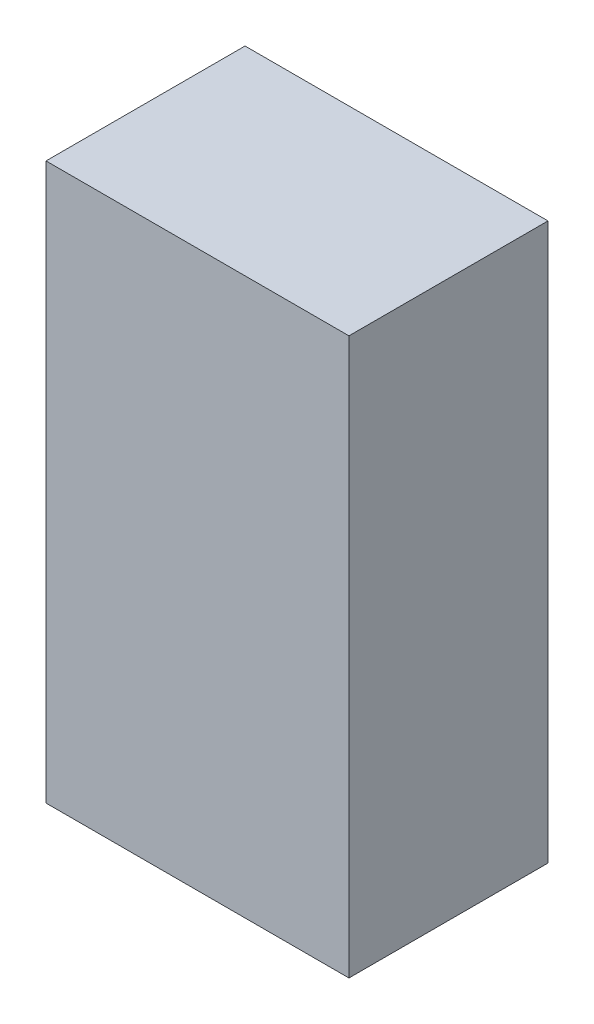
ISO-10303-21;
HEADER;
FILE_DESCRIPTION(('STEP AP214'),'2;1');
FILE_NAME('part.step','',(''),(''),'','','');
FILE_SCHEMA(('AUTOMOTIVE_DESIGN { 1 0 10303 214 1 1 1 1 }'));
ENDSEC;
DATA;
#1=APPLICATION_CONTEXT('core data for automotive mechanical design processes');
#2=APPLICATION_PROTOCOL_DEFINITION('international standard','automotive_design',2000,#1);
#3=PRODUCT_CONTEXT('',#1,'mechanical');
#4=PRODUCT('Part','Part','',(#3));
#5=PRODUCT_RELATED_PRODUCT_CATEGORY('part','',(#4));
#6=PRODUCT_DEFINITION_FORMATION('','',#4);
#7=PRODUCT_DEFINITION_CONTEXT('part definition',#1,'design');
#8=PRODUCT_DEFINITION('design','',#6,#7);
#9=PRODUCT_DEFINITION_SHAPE('','',#8);
#10=(LENGTH_UNIT() NAMED_UNIT(*) SI_UNIT(.MILLI.,.METRE.));
#11=(NAMED_UNIT(*) PLANE_ANGLE_UNIT() SI_UNIT($,.RADIAN.));
#12=(NAMED_UNIT(*) SI_UNIT($,.STERADIAN.) SOLID_ANGLE_UNIT());
#13=UNCERTAINTY_MEASURE_WITH_UNIT(LENGTH_MEASURE(1.E-05),#10,'distance_accuracy_value','');
#14=(GEOMETRIC_REPRESENTATION_CONTEXT(3) GLOBAL_UNCERTAINTY_ASSIGNED_CONTEXT((#13)) GLOBAL_UNIT_ASSIGNED_CONTEXT((#10,
#11,#12)) REPRESENTATION_CONTEXT('',''));
#15=CARTESIAN_POINT('',(0.,0.,0.));
#16=DIRECTION('',(0.,0.,1.));
#17=DIRECTION('',(1.,0.,0.));
#18=AXIS2_PLACEMENT_3D('',#15,#16,#17);
#19=CARTESIAN_POINT('',(0.,0.,13.6));
#20=DIRECTION('',(1.,0.,0.));
#21=DIRECTION('',(0.,1.,0.));
#22=AXIS2_PLACEMENT_3D('',#19,#20,#21);
#23=PLANE('',#22);
#24=DIRECTION('',(0.,-1.,0.));
#25=VECTOR('',#24,1.);
#26=CARTESIAN_POINT('',(0.,0.,0.));
#27=LINE('',#26,#25);
#28=CARTESIAN_POINT('',(0.,0.,0.));
#29=VERTEX_POINT('',#28);
#30=CARTESIAN_POINT('',(0.,-38.,0.));
#31=VERTEX_POINT('',#30);
#32=EDGE_CURVE('E100',#29,#31,#27,.T.);
#33=ORIENTED_EDGE('',*,*,#32,.T.);
#34=DIRECTION('',(0.,0.,-1.));
#35=VECTOR('',#34,1.);
#36=CARTESIAN_POINT('',(0.,-38.,13.6));
#37=LINE('',#36,#35);
#38=CARTESIAN_POINT('',(0.,-38.,13.6));
#39=VERTEX_POINT('',#38);
#40=EDGE_CURVE('E11',#39,#31,#37,.T.);
#41=ORIENTED_EDGE('',*,*,#40,.F.);
#42=DIRECTION('',(0.,-1.,0.));
#43=VECTOR('',#42,1.);
#44=CARTESIAN_POINT('',(0.,0.,13.6));
#45=LINE('',#44,#43);
#46=CARTESIAN_POINT('',(0.,0.,13.6));
#47=VERTEX_POINT('',#46);
#48=EDGE_CURVE('E88',#47,#39,#45,.T.);
#49=ORIENTED_EDGE('',*,*,#48,.F.);
#50=DIRECTION('',(0.,0.,-1.));
#51=VECTOR('',#50,1.);
#52=CARTESIAN_POINT('',(0.,0.,13.6));
#53=LINE('',#52,#51);
#54=EDGE_CURVE('E96',#47,#29,#53,.T.);
#55=ORIENTED_EDGE('',*,*,#54,.T.);
#56=EDGE_LOOP('',(#33,#41,#49,#55));
#57=FACE_BOUND('',#56,.T.);
#58=ADVANCED_FACE('F37',(#57),#23,.F.);
#59=CARTESIAN_POINT('',(0.,-38.,13.6));
#60=DIRECTION('',(0.,1.,0.));
#61=DIRECTION('',(0.,0.,1.));
#62=AXIS2_PLACEMENT_3D('',#59,#60,#61);
#63=PLANE('',#62);
#64=DIRECTION('',(1.,0.,0.));
#65=VECTOR('',#64,1.);
#66=CARTESIAN_POINT('',(0.,-38.,0.));
#67=LINE('',#66,#65);
#68=CARTESIAN_POINT('',(20.7,-38.,0.));
#69=VERTEX_POINT('',#68);
#70=EDGE_CURVE('E92',#31,#69,#67,.T.);
#71=ORIENTED_EDGE('',*,*,#70,.T.);
#72=DIRECTION('',(0.,0.,-1.));
#73=VECTOR('',#72,1.);
#74=CARTESIAN_POINT('',(20.7,-38.,13.6));
#75=LINE('',#74,#73);
#76=CARTESIAN_POINT('',(20.7,-38.,13.6));
#77=VERTEX_POINT('',#76);
#78=EDGE_CURVE('E45',#77,#69,#75,.T.);
#79=ORIENTED_EDGE('',*,*,#78,.F.);
#80=DIRECTION('',(1.,0.,0.));
#81=VECTOR('',#80,1.);
#82=CARTESIAN_POINT('',(0.,-38.,13.6));
#83=LINE('',#82,#81);
#84=EDGE_CURVE('E83',#39,#77,#83,.T.);
#85=ORIENTED_EDGE('',*,*,#84,.F.);
#86=ORIENTED_EDGE('',*,*,#40,.T.);
#87=EDGE_LOOP('',(#71,#79,#85,#86));
#88=FACE_BOUND('',#87,.T.);
#89=ADVANCED_FACE('F91',(#88),#63,.F.);
#90=CARTESIAN_POINT('',(20.7,0.,13.6));
#91=DIRECTION('',(-1.,0.,0.));
#92=DIRECTION('',(0.,-1.,0.));
#93=AXIS2_PLACEMENT_3D('',#90,#91,#92);
#94=PLANE('',#93);
#95=DIRECTION('',(0.,1.,0.));
#96=VECTOR('',#95,1.);
#97=CARTESIAN_POINT('',(20.7,0.,0.));
#98=LINE('',#97,#96);
#99=CARTESIAN_POINT('',(20.7,0.,0.));
#100=VERTEX_POINT('',#99);
#101=EDGE_CURVE('E70',#69,#100,#98,.T.);
#102=ORIENTED_EDGE('',*,*,#101,.T.);
#103=DIRECTION('',(0.,0.,-1.));
#104=VECTOR('',#103,1.);
#105=CARTESIAN_POINT('',(20.7,0.,13.6));
#106=LINE('',#105,#104);
#107=CARTESIAN_POINT('',(20.7,0.,13.6));
#108=VERTEX_POINT('',#107);
#109=EDGE_CURVE('E93',#108,#100,#106,.T.);
#110=ORIENTED_EDGE('',*,*,#109,.F.);
#111=DIRECTION('',(0.,1.,0.));
#112=VECTOR('',#111,1.);
#113=CARTESIAN_POINT('',(20.7,0.,13.6));
#114=LINE('',#113,#112);
#115=EDGE_CURVE('E86',#77,#108,#114,.T.);
#116=ORIENTED_EDGE('',*,*,#115,.F.);
#117=ORIENTED_EDGE('',*,*,#78,.T.);
#118=EDGE_LOOP('',(#102,#110,#116,#117));
#119=FACE_BOUND('',#118,.T.);
#120=ADVANCED_FACE('F94',(#119),#94,.F.);
#121=CARTESIAN_POINT('',(0.,0.,13.6));
#122=DIRECTION('',(0.,-1.,0.));
#123=DIRECTION('',(0.,0.,-1.));
#124=AXIS2_PLACEMENT_3D('',#121,#122,#123);
#125=PLANE('',#124);
#126=DIRECTION('',(-1.,0.,0.));
#127=VECTOR('',#126,1.);
#128=CARTESIAN_POINT('',(0.,0.,0.));
#129=LINE('',#128,#127);
#130=EDGE_CURVE('E76',#100,#29,#129,.T.);
#131=ORIENTED_EDGE('',*,*,#130,.T.);
#132=ORIENTED_EDGE('',*,*,#54,.F.);
#133=DIRECTION('',(-1.,0.,0.));
#134=VECTOR('',#133,1.);
#135=CARTESIAN_POINT('',(0.,0.,13.6));
#136=LINE('',#135,#134);
#137=EDGE_CURVE('E53',#108,#47,#136,.T.);
#138=ORIENTED_EDGE('',*,*,#137,.F.);
#139=ORIENTED_EDGE('',*,*,#109,.T.);
#140=EDGE_LOOP('',(#131,#132,#138,#139));
#141=FACE_BOUND('',#140,.T.);
#142=ADVANCED_FACE('F107',(#141),#125,.F.);
#143=CARTESIAN_POINT('',(0.,0.,13.6));
#144=DIRECTION('',(0.,0.,1.));
#145=DIRECTION('',(1.,0.,0.));
#146=AXIS2_PLACEMENT_3D('',#143,#144,#145);
#147=PLANE('',#146);
#148=ORIENTED_EDGE('',*,*,#48,.T.);
#149=ORIENTED_EDGE('',*,*,#84,.T.);
#150=ORIENTED_EDGE('',*,*,#115,.T.);
#151=ORIENTED_EDGE('',*,*,#137,.T.);
#152=EDGE_LOOP('',(#148,#149,#150,#151));
#153=FACE_BOUND('',#152,.T.);
#154=ADVANCED_FACE('F84',(#153),#147,.T.);
#155=CARTESIAN_POINT('',(0.,0.,0.));
#156=DIRECTION('',(0.,0.,1.));
#157=DIRECTION('',(1.,0.,0.));
#158=AXIS2_PLACEMENT_3D('',#155,#156,#157);
#159=PLANE('',#158);
#160=ORIENTED_EDGE('',*,*,#32,.F.);
#161=ORIENTED_EDGE('',*,*,#130,.F.);
#162=ORIENTED_EDGE('',*,*,#101,.F.);
#163=ORIENTED_EDGE('',*,*,#70,.F.);
#164=EDGE_LOOP('',(#160,#161,#162,#163));
#165=FACE_BOUND('',#164,.T.);
#166=ADVANCED_FACE('F110',(#165),#159,.F.);
#167=CLOSED_SHELL('',(#58,#89,#120,#142,#154,#166));
#168=MANIFOLD_SOLID_BREP('B2',#167);
#169=ADVANCED_BREP_SHAPE_REPRESENTATION('',(#18,#168),#14);
#170=SHAPE_DEFINITION_REPRESENTATION(#9,#169);
ENDSEC;
END-ISO-10303-21;
